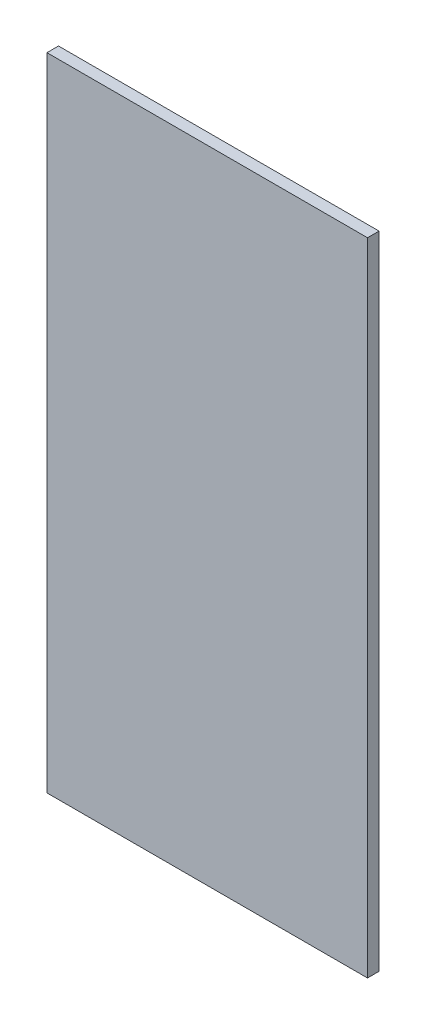
ISO-10303-21;
HEADER;
FILE_DESCRIPTION(('STEP AP214'),'2;1');
FILE_NAME('part.step','',(''),(''),'','','');
FILE_SCHEMA(('AUTOMOTIVE_DESIGN { 1 0 10303 214 1 1 1 1 }'));
ENDSEC;
DATA;
#1=APPLICATION_CONTEXT('core data for automotive mechanical design processes');
#2=APPLICATION_PROTOCOL_DEFINITION('international standard','automotive_design',2000,#1);
#3=PRODUCT_CONTEXT('',#1,'mechanical');
#4=PRODUCT('Part','Part','',(#3));
#5=PRODUCT_RELATED_PRODUCT_CATEGORY('part','',(#4));
#6=PRODUCT_DEFINITION_FORMATION('','',#4);
#7=PRODUCT_DEFINITION_CONTEXT('part definition',#1,'design');
#8=PRODUCT_DEFINITION('design','',#6,#7);
#9=PRODUCT_DEFINITION_SHAPE('','',#8);
#10=(LENGTH_UNIT() NAMED_UNIT(*) SI_UNIT(.MILLI.,.METRE.));
#11=(NAMED_UNIT(*) PLANE_ANGLE_UNIT() SI_UNIT($,.RADIAN.));
#12=(NAMED_UNIT(*) SI_UNIT($,.STERADIAN.) SOLID_ANGLE_UNIT());
#13=UNCERTAINTY_MEASURE_WITH_UNIT(LENGTH_MEASURE(1.E-05),#10,'distance_accuracy_value','');
#14=(GEOMETRIC_REPRESENTATION_CONTEXT(3) GLOBAL_UNCERTAINTY_ASSIGNED_CONTEXT((#13)) GLOBAL_UNIT_ASSIGNED_CONTEXT((#10,
#11,#12)) REPRESENTATION_CONTEXT('',''));
#15=CARTESIAN_POINT('',(0.,0.,0.));
#16=DIRECTION('',(0.,0.,1.));
#17=DIRECTION('',(1.,0.,0.));
#18=AXIS2_PLACEMENT_3D('',#15,#16,#17);
#19=CARTESIAN_POINT('',(0.375,-0.5,-0.018));
#20=DIRECTION('',(-1.,0.,0.));
#21=DIRECTION('',(0.,0.,-1.));
#22=AXIS2_PLACEMENT_3D('',#19,#20,#21);
#23=PLANE('',#22);
#24=CARTESIAN_POINT('',(0.375,-0.5,-0.018));
#25=CARTESIAN_POINT('',(0.375,-1.5,-0.018));
#26=B_SPLINE_CURVE_WITH_KNOTS('',1,(#24,#25),.UNSPECIFIED.,.F.,.F.,(2,2),(0.,1.),.UNSPECIFIED.);
#27=CARTESIAN_POINT('',(0.375,-0.5,-0.018));
#28=VERTEX_POINT('',#27);
#29=CARTESIAN_POINT('',(0.375,-1.5,-0.018));
#30=VERTEX_POINT('',#29);
#31=EDGE_CURVE('E11',#28,#30,#26,.T.);
#32=ORIENTED_EDGE('',*,*,#31,.T.);
#33=CARTESIAN_POINT('',(0.375,-1.5,-0.018));
#34=CARTESIAN_POINT('',(0.375,-1.5,0.));
#35=B_SPLINE_CURVE_WITH_KNOTS('',1,(#33,#34),.UNSPECIFIED.,.F.,.F.,(2,2),(0.,0.018),.UNSPECIFIED.);
#36=CARTESIAN_POINT('',(0.375,-1.5,0.));
#37=VERTEX_POINT('',#36);
#38=EDGE_CURVE('E26',#30,#37,#35,.T.);
#39=ORIENTED_EDGE('',*,*,#38,.T.);
#40=CARTESIAN_POINT('',(0.375,-0.5,0.));
#41=CARTESIAN_POINT('',(0.375,-1.5,0.));
#42=B_SPLINE_CURVE_WITH_KNOTS('',1,(#40,#41),.UNSPECIFIED.,.F.,.F.,(2,2),(0.,1.),.UNSPECIFIED.);
#43=CARTESIAN_POINT('',(0.375,-0.5,0.));
#44=VERTEX_POINT('',#43);
#45=EDGE_CURVE('E132',#44,#37,#42,.T.);
#46=ORIENTED_EDGE('',*,*,#45,.F.);
#47=CARTESIAN_POINT('',(0.375,-0.5,-0.018));
#48=CARTESIAN_POINT('',(0.375,-0.5,0.));
#49=B_SPLINE_CURVE_WITH_KNOTS('',1,(#47,#48),.UNSPECIFIED.,.F.,.F.,(2,2),(0.,0.018),.UNSPECIFIED.);
#50=EDGE_CURVE('E79',#28,#44,#49,.T.);
#51=ORIENTED_EDGE('',*,*,#50,.F.);
#52=EDGE_LOOP('',(#32,#39,#46,#51));
#53=FACE_BOUND('',#52,.T.);
#54=ADVANCED_FACE('F17',(#53),#23,.T.);
#55=CARTESIAN_POINT('',(0.375,-1.5,-0.018));
#56=DIRECTION('',(0.,-1.,0.));
#57=DIRECTION('',(0.,0.,-1.));
#58=AXIS2_PLACEMENT_3D('',#55,#56,#57);
#59=PLANE('',#58);
#60=CARTESIAN_POINT('',(0.375,-1.5,-0.018));
#61=CARTESIAN_POINT('',(0.875,-1.5,-0.018));
#62=B_SPLINE_CURVE_WITH_KNOTS('',1,(#60,#61),.UNSPECIFIED.,.F.,.F.,(2,2),(1.,1.5),.UNSPECIFIED.);
#63=CARTESIAN_POINT('',(0.875,-1.5,-0.018));
#64=VERTEX_POINT('',#63);
#65=EDGE_CURVE('E119',#30,#64,#62,.T.);
#66=ORIENTED_EDGE('',*,*,#65,.T.);
#67=CARTESIAN_POINT('',(0.875,-1.5,-0.018));
#68=CARTESIAN_POINT('',(0.875,-1.5,0.));
#69=B_SPLINE_CURVE_WITH_KNOTS('',1,(#67,#68),.UNSPECIFIED.,.F.,.F.,(2,2),(0.,0.018),.UNSPECIFIED.);
#70=CARTESIAN_POINT('',(0.875,-1.5,0.));
#71=VERTEX_POINT('',#70);
#72=EDGE_CURVE('E112',#64,#71,#69,.T.);
#73=ORIENTED_EDGE('',*,*,#72,.T.);
#74=CARTESIAN_POINT('',(0.375,-1.5,0.));
#75=CARTESIAN_POINT('',(0.875,-1.5,0.));
#76=B_SPLINE_CURVE_WITH_KNOTS('',1,(#74,#75),.UNSPECIFIED.,.F.,.F.,(2,2),(1.,1.5),.UNSPECIFIED.);
#77=EDGE_CURVE('E74',#37,#71,#76,.T.);
#78=ORIENTED_EDGE('',*,*,#77,.F.);
#79=ORIENTED_EDGE('',*,*,#38,.F.);
#80=EDGE_LOOP('',(#66,#73,#78,#79));
#81=FACE_BOUND('',#80,.T.);
#82=ADVANCED_FACE('F147',(#81),#59,.T.);
#83=CARTESIAN_POINT('',(0.875,-1.5,-0.018));
#84=DIRECTION('',(1.,0.,0.));
#85=DIRECTION('',(0.,0.,1.));
#86=AXIS2_PLACEMENT_3D('',#83,#84,#85);
#87=PLANE('',#86);
#88=CARTESIAN_POINT('',(0.875,-1.5,-0.018));
#89=CARTESIAN_POINT('',(0.875,-0.5,-0.018));
#90=B_SPLINE_CURVE_WITH_KNOTS('',1,(#88,#89),.UNSPECIFIED.,.F.,.F.,(2,2),(1.5,2.5),.UNSPECIFIED.);
#91=CARTESIAN_POINT('',(0.875,-0.5,-0.018));
#92=VERTEX_POINT('',#91);
#93=EDGE_CURVE('E62',#64,#92,#90,.T.);
#94=ORIENTED_EDGE('',*,*,#93,.T.);
#95=CARTESIAN_POINT('',(0.875,-0.5,-0.018));
#96=CARTESIAN_POINT('',(0.875,-0.5,0.));
#97=B_SPLINE_CURVE_WITH_KNOTS('',1,(#95,#96),.UNSPECIFIED.,.F.,.F.,(2,2),(0.,0.018),.UNSPECIFIED.);
#98=CARTESIAN_POINT('',(0.875,-0.5,0.));
#99=VERTEX_POINT('',#98);
#100=EDGE_CURVE('E56',#92,#99,#97,.T.);
#101=ORIENTED_EDGE('',*,*,#100,.T.);
#102=CARTESIAN_POINT('',(0.875,-1.5,0.));
#103=CARTESIAN_POINT('',(0.875,-0.5,0.));
#104=B_SPLINE_CURVE_WITH_KNOTS('',1,(#102,#103),.UNSPECIFIED.,.F.,.F.,(2,2),(1.5,2.5),.UNSPECIFIED.);
#105=EDGE_CURVE('E60',#71,#99,#104,.T.);
#106=ORIENTED_EDGE('',*,*,#105,.F.);
#107=ORIENTED_EDGE('',*,*,#72,.F.);
#108=EDGE_LOOP('',(#94,#101,#106,#107));
#109=FACE_BOUND('',#108,.T.);
#110=ADVANCED_FACE('F58',(#109),#87,.T.);
#111=CARTESIAN_POINT('',(0.875,-0.5,-0.018));
#112=DIRECTION('',(0.,1.,0.));
#113=DIRECTION('',(0.,0.,1.));
#114=AXIS2_PLACEMENT_3D('',#111,#112,#113);
#115=PLANE('',#114);
#116=CARTESIAN_POINT('',(0.875,-0.5,-0.018));
#117=CARTESIAN_POINT('',(0.375,-0.5,-0.018));
#118=B_SPLINE_CURVE_WITH_KNOTS('',1,(#116,#117),.UNSPECIFIED.,.F.,.F.,(2,2),(2.5,3.),.UNSPECIFIED.);
#119=EDGE_CURVE('E75',#92,#28,#118,.T.);
#120=ORIENTED_EDGE('',*,*,#119,.T.);
#121=ORIENTED_EDGE('',*,*,#50,.T.);
#122=CARTESIAN_POINT('',(0.875,-0.5,0.));
#123=CARTESIAN_POINT('',(0.375,-0.5,0.));
#124=B_SPLINE_CURVE_WITH_KNOTS('',1,(#122,#123),.UNSPECIFIED.,.F.,.F.,(2,2),(2.5,3.),.UNSPECIFIED.);
#125=EDGE_CURVE('E72',#99,#44,#124,.T.);
#126=ORIENTED_EDGE('',*,*,#125,.F.);
#127=ORIENTED_EDGE('',*,*,#100,.F.);
#128=EDGE_LOOP('',(#120,#121,#126,#127));
#129=FACE_BOUND('',#128,.T.);
#130=ADVANCED_FACE('F78',(#129),#115,.T.);
#131=CARTESIAN_POINT('',(0.375,-1.5,-0.018));
#132=DIRECTION('',(0.,0.,-1.));
#133=DIRECTION('',(-1.,0.,0.));
#134=AXIS2_PLACEMENT_3D('',#131,#132,#133);
#135=PLANE('',#134);
#136=ORIENTED_EDGE('',*,*,#119,.F.);
#137=ORIENTED_EDGE('',*,*,#93,.F.);
#138=ORIENTED_EDGE('',*,*,#65,.F.);
#139=ORIENTED_EDGE('',*,*,#31,.F.);
#140=EDGE_LOOP('',(#136,#137,#138,#139));
#141=FACE_BOUND('',#140,.T.);
#142=ADVANCED_FACE('F148',(#141),#135,.T.);
#143=CARTESIAN_POINT('',(0.375,-1.5,0.));
#144=DIRECTION('',(0.,0.,1.));
#145=DIRECTION('',(1.,0.,0.));
#146=AXIS2_PLACEMENT_3D('',#143,#144,#145);
#147=PLANE('',#146);
#148=ORIENTED_EDGE('',*,*,#45,.T.);
#149=ORIENTED_EDGE('',*,*,#77,.T.);
#150=ORIENTED_EDGE('',*,*,#105,.T.);
#151=ORIENTED_EDGE('',*,*,#125,.T.);
#152=EDGE_LOOP('',(#148,#149,#150,#151));
#153=FACE_BOUND('',#152,.T.);
#154=ADVANCED_FACE('F71',(#153),#147,.T.);
#155=CLOSED_SHELL('',(#54,#82,#110,#130,#142,#154));
#156=MANIFOLD_SOLID_BREP('B1',#155);
#157=ADVANCED_BREP_SHAPE_REPRESENTATION('',(#18,#156),#14);
#158=SHAPE_DEFINITION_REPRESENTATION(#9,#157);
ENDSEC;
END-ISO-10303-21;
